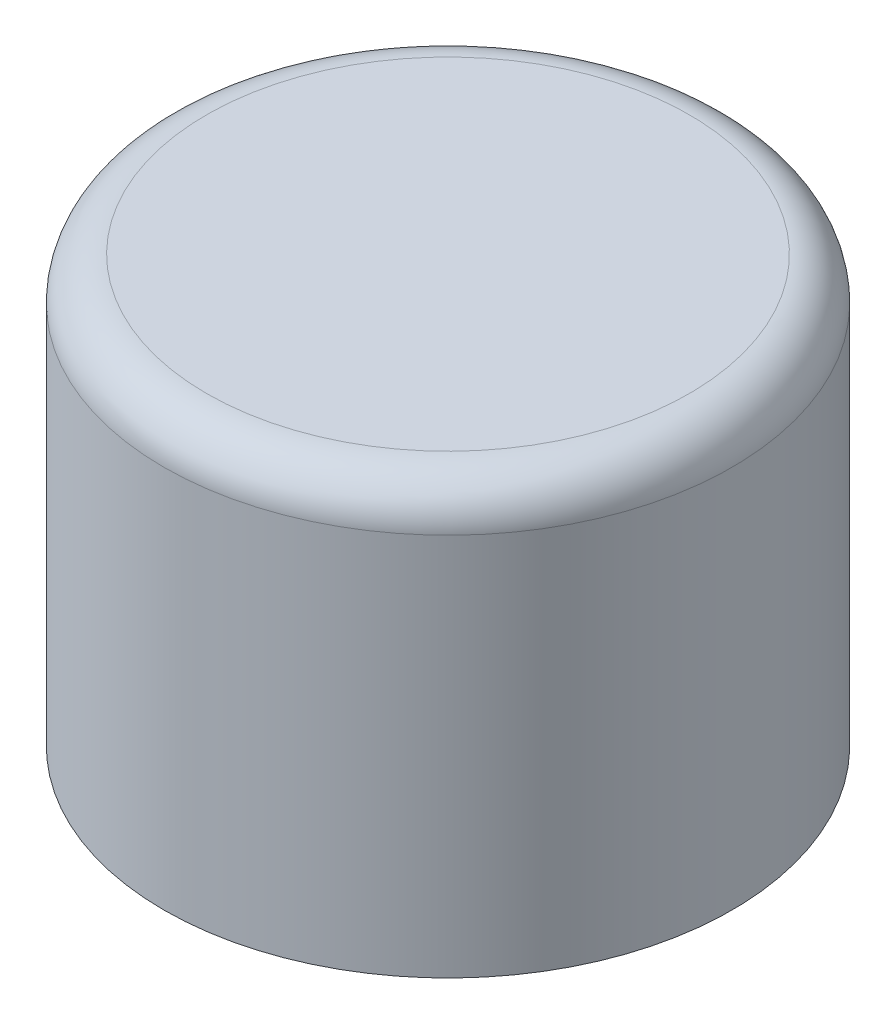
ISO-10303-21;
HEADER;
FILE_DESCRIPTION(('STEP AP214'),'2;1');
FILE_NAME('part.step','',(''),(''),'','','');
FILE_SCHEMA(('AUTOMOTIVE_DESIGN { 1 0 10303 214 1 1 1 1 }'));
ENDSEC;
DATA;
#1=APPLICATION_CONTEXT('core data for automotive mechanical design processes');
#2=APPLICATION_PROTOCOL_DEFINITION('international standard','automotive_design',2000,#1);
#3=PRODUCT_CONTEXT('',#1,'mechanical');
#4=PRODUCT('Part','Part','',(#3));
#5=PRODUCT_RELATED_PRODUCT_CATEGORY('part','',(#4));
#6=PRODUCT_DEFINITION_FORMATION('','',#4);
#7=PRODUCT_DEFINITION_CONTEXT('part definition',#1,'design');
#8=PRODUCT_DEFINITION('design','',#6,#7);
#9=PRODUCT_DEFINITION_SHAPE('','',#8);
#10=(LENGTH_UNIT() NAMED_UNIT(*) SI_UNIT(.MILLI.,.METRE.));
#11=(NAMED_UNIT(*) PLANE_ANGLE_UNIT() SI_UNIT($,.RADIAN.));
#12=(NAMED_UNIT(*) SI_UNIT($,.STERADIAN.) SOLID_ANGLE_UNIT());
#13=UNCERTAINTY_MEASURE_WITH_UNIT(LENGTH_MEASURE(1.E-05),#10,'distance_accuracy_value','');
#14=(GEOMETRIC_REPRESENTATION_CONTEXT(3) GLOBAL_UNCERTAINTY_ASSIGNED_CONTEXT((#13)) GLOBAL_UNIT_ASSIGNED_CONTEXT((#10,
#11,#12)) REPRESENTATION_CONTEXT('',''));
#15=CARTESIAN_POINT('',(0.,0.,0.));
#16=DIRECTION('',(0.,0.,1.));
#17=DIRECTION('',(1.,0.,0.));
#18=AXIS2_PLACEMENT_3D('',#15,#16,#17);
#19=CARTESIAN_POINT('',(0.,3.,0.));
#20=DIRECTION('',(0.,-1.,0.));
#21=DIRECTION('',(0.,0.,-1.));
#22=AXIS2_PLACEMENT_3D('',#19,#20,#21);
#23=CYLINDRICAL_SURFACE('',#22,2.);
#24=CARTESIAN_POINT('',(0.,2.7,0.));
#25=DIRECTION('',(0.,1.,0.));
#26=DIRECTION('',(0.,0.,1.));
#27=AXIS2_PLACEMENT_3D('',#24,#25,#26);
#28=CIRCLE('',#27,2.);
#29=CARTESIAN_POINT('',(0.,2.7,2.));
#30=VERTEX_POINT('',#29);
#31=EDGE_CURVE('E10',#30,#30,#28,.F.);
#32=ORIENTED_EDGE('',*,*,#31,.T.);
#33=EDGE_LOOP('',(#32));
#34=FACE_BOUND('',#33,.T.);
#35=CARTESIAN_POINT('',(0.,0.,0.));
#36=DIRECTION('',(0.,1.,0.));
#37=DIRECTION('',(0.,0.,1.));
#38=AXIS2_PLACEMENT_3D('',#35,#36,#37);
#39=CIRCLE('',#38,2.);
#40=CARTESIAN_POINT('',(0.,0.,2.));
#41=VERTEX_POINT('',#40);
#42=EDGE_CURVE('E38',#41,#41,#39,.T.);
#43=ORIENTED_EDGE('',*,*,#42,.T.);
#44=EDGE_LOOP('',(#43));
#45=FACE_BOUND('',#44,.T.);
#46=ADVANCED_FACE('F28',(#34,#45),#23,.T.);
#47=CARTESIAN_POINT('',(0.,3.,0.));
#48=DIRECTION('',(0.,1.,0.));
#49=DIRECTION('',(0.,0.,1.));
#50=AXIS2_PLACEMENT_3D('',#47,#48,#49);
#51=PLANE('',#50);
#52=CARTESIAN_POINT('',(0.,3.,0.));
#53=DIRECTION('',(0.,1.,0.));
#54=DIRECTION('',(0.,0.,1.));
#55=AXIS2_PLACEMENT_3D('',#52,#53,#54);
#56=CIRCLE('',#55,1.7);
#57=CARTESIAN_POINT('',(0.,3.,1.7));
#58=VERTEX_POINT('',#57);
#59=EDGE_CURVE('E34',#58,#58,#56,.T.);
#60=ORIENTED_EDGE('',*,*,#59,.T.);
#61=EDGE_LOOP('',(#60));
#62=FACE_BOUND('',#61,.T.);
#63=ADVANCED_FACE('F49',(#62),#51,.T.);
#64=CARTESIAN_POINT('',(0.,0.,0.));
#65=DIRECTION('',(0.,1.,0.));
#66=DIRECTION('',(0.,0.,1.));
#67=AXIS2_PLACEMENT_3D('',#64,#65,#66);
#68=PLANE('',#67);
#69=ORIENTED_EDGE('',*,*,#42,.F.);
#70=EDGE_LOOP('',(#69));
#71=FACE_BOUND('',#70,.T.);
#72=ADVANCED_FACE('F46',(#71),#68,.F.);
#73=CARTESIAN_POINT('',(0.,2.7,0.));
#74=DIRECTION('',(0.,1.,0.));
#75=DIRECTION('',(0.,0.,1.));
#76=AXIS2_PLACEMENT_3D('',#73,#74,#75);
#77=TOROIDAL_SURFACE('',#76,1.7,0.3);
#78=ORIENTED_EDGE('',*,*,#31,.F.);
#79=EDGE_LOOP('',(#78));
#80=FACE_BOUND('',#79,.T.);
#81=ORIENTED_EDGE('',*,*,#59,.F.);
#82=EDGE_LOOP('',(#81));
#83=FACE_BOUND('',#82,.T.);
#84=ADVANCED_FACE('F48',(#80,#83),#77,.T.);
#85=CLOSED_SHELL('',(#46,#63,#72,#84));
#86=MANIFOLD_SOLID_BREP('B2',#85);
#87=ADVANCED_BREP_SHAPE_REPRESENTATION('',(#18,#86),#14);
#88=SHAPE_DEFINITION_REPRESENTATION(#9,#87);
ENDSEC;
END-ISO-10303-21;
